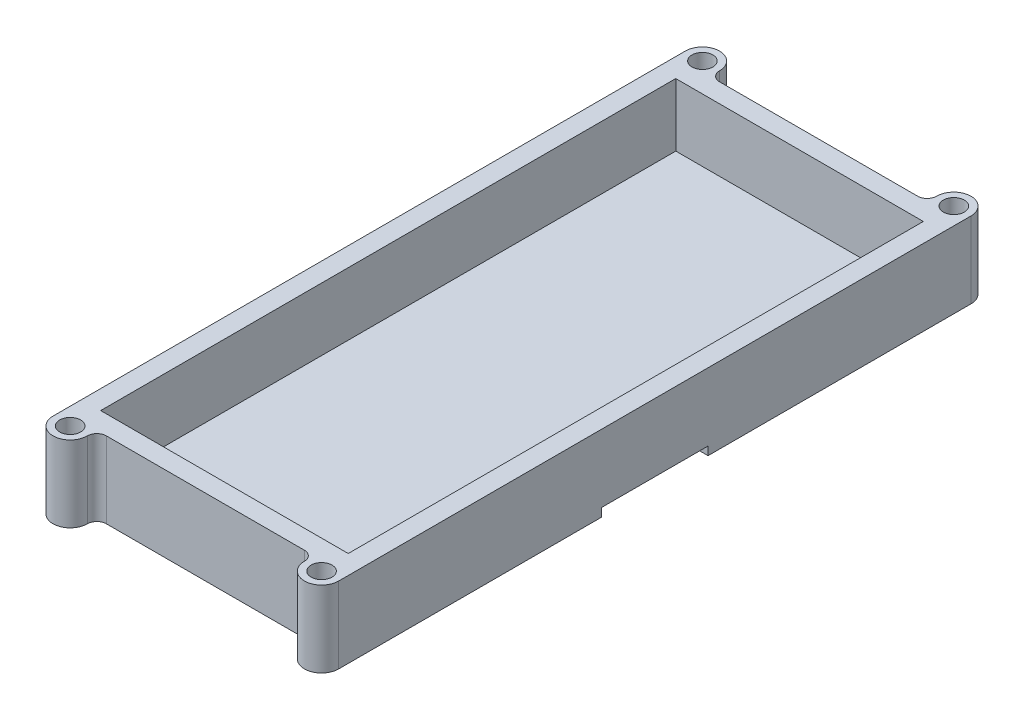
ISO-10303-21;
HEADER;
FILE_DESCRIPTION(('STEP AP214'),'2;1');
FILE_NAME('part.step','',(''),(''),'','','');
FILE_SCHEMA(('AUTOMOTIVE_DESIGN { 1 0 10303 214 1 1 1 1 }'));
ENDSEC;
DATA;
#1=APPLICATION_CONTEXT('core data for automotive mechanical design processes');
#2=APPLICATION_PROTOCOL_DEFINITION('international standard','automotive_design',2000,#1);
#3=PRODUCT_CONTEXT('',#1,'mechanical');
#4=PRODUCT('Part','Part','',(#3));
#5=PRODUCT_RELATED_PRODUCT_CATEGORY('part','',(#4));
#6=PRODUCT_DEFINITION_FORMATION('','',#4);
#7=PRODUCT_DEFINITION_CONTEXT('part definition',#1,'design');
#8=PRODUCT_DEFINITION('design','',#6,#7);
#9=PRODUCT_DEFINITION_SHAPE('','',#8);
#10=(LENGTH_UNIT() NAMED_UNIT(*) SI_UNIT(.MILLI.,.METRE.));
#11=(NAMED_UNIT(*) PLANE_ANGLE_UNIT() SI_UNIT($,.RADIAN.));
#12=(NAMED_UNIT(*) SI_UNIT($,.STERADIAN.) SOLID_ANGLE_UNIT());
#13=UNCERTAINTY_MEASURE_WITH_UNIT(LENGTH_MEASURE(1.E-05),#10,'distance_accuracy_value','');
#14=(GEOMETRIC_REPRESENTATION_CONTEXT(3) GLOBAL_UNCERTAINTY_ASSIGNED_CONTEXT((#13)) GLOBAL_UNIT_ASSIGNED_CONTEXT((#10,
#11,#12)) REPRESENTATION_CONTEXT('',''));
#15=CARTESIAN_POINT('',(0.,0.,0.));
#16=DIRECTION('',(0.,0.,1.));
#17=DIRECTION('',(1.,0.,0.));
#18=AXIS2_PLACEMENT_3D('',#15,#16,#17);
#19=CARTESIAN_POINT('',(33.,0.,83.));
#20=DIRECTION('',(0.,-1.,0.));
#21=DIRECTION('',(0.,0.,-1.));
#22=AXIS2_PLACEMENT_3D('',#19,#20,#21);
#23=PLANE('',#22);
#24=DIRECTION('',(-1.,0.,0.));
#25=VECTOR('',#24,1.);
#26=CARTESIAN_POINT('',(37.5,0.,-13.97));
#27=LINE('',#26,#25);
#28=CARTESIAN_POINT('',(37.5,0.,-13.97));
#29=VERTEX_POINT('',#28);
#30=CARTESIAN_POINT('',(-37.5000000000001,0.,-13.97));
#31=VERTEX_POINT('',#30);
#32=EDGE_CURVE('E177',#29,#31,#27,.T.);
#33=ORIENTED_EDGE('',*,*,#32,.T.);
#34=DIRECTION('',(0.,0.,1.));
#35=VECTOR('',#34,1.);
#36=CARTESIAN_POINT('',(-37.5,0.,75.5));
#37=LINE('',#36,#35);
#38=CARTESIAN_POINT('',(-37.5,0.,-83.));
#39=VERTEX_POINT('',#38);
#40=EDGE_CURVE('E230',#39,#31,#37,.T.);
#41=ORIENTED_EDGE('',*,*,#40,.F.);
#42=CARTESIAN_POINT('',(-33.,0.,-83.));
#43=DIRECTION('',(0.,1.,0.));
#44=DIRECTION('',(0.,0.,-1.));
#45=AXIS2_PLACEMENT_3D('',#42,#43,#44);
#46=CIRCLE('',#45,4.5);
#47=CARTESIAN_POINT('',(-28.5,0.,-83.));
#48=VERTEX_POINT('',#47);
#49=EDGE_CURVE('E225',#48,#39,#46,.T.);
#50=ORIENTED_EDGE('',*,*,#49,.F.);
#51=CARTESIAN_POINT('',(-26.,0.,-83.));
#52=DIRECTION('',(0.,-1.,0.));
#53=DIRECTION('',(0.,0.,-1.));
#54=AXIS2_PLACEMENT_3D('',#51,#52,#53);
#55=CIRCLE('',#54,2.5);
#56=CARTESIAN_POINT('',(-26.,0.,-80.5));
#57=VERTEX_POINT('',#56);
#58=EDGE_CURVE('E48',#48,#57,#55,.F.);
#59=ORIENTED_EDGE('',*,*,#58,.T.);
#60=DIRECTION('',(-1.,0.,0.));
#61=VECTOR('',#60,1.);
#62=CARTESIAN_POINT('',(-28.5,0.,-80.5));
#63=LINE('',#62,#61);
#64=CARTESIAN_POINT('',(26.,0.,-80.5));
#65=VERTEX_POINT('',#64);
#66=EDGE_CURVE('E222',#65,#57,#63,.T.);
#67=ORIENTED_EDGE('',*,*,#66,.F.);
#68=CARTESIAN_POINT('',(26.,0.,-83.));
#69=DIRECTION('',(0.,-1.,0.));
#70=DIRECTION('',(0.,0.,-1.));
#71=AXIS2_PLACEMENT_3D('',#68,#69,#70);
#72=CIRCLE('',#71,2.5);
#73=CARTESIAN_POINT('',(28.5,0.,-83.));
#74=VERTEX_POINT('',#73);
#75=EDGE_CURVE('E302',#65,#74,#72,.F.);
#76=ORIENTED_EDGE('',*,*,#75,.T.);
#77=CARTESIAN_POINT('',(33.,0.,-83.));
#78=DIRECTION('',(0.,1.,0.));
#79=DIRECTION('',(0.,0.,1.));
#80=AXIS2_PLACEMENT_3D('',#77,#78,#79);
#81=CIRCLE('',#80,4.5);
#82=CARTESIAN_POINT('',(37.5,0.,-83.));
#83=VERTEX_POINT('',#82);
#84=EDGE_CURVE('E205',#83,#74,#81,.T.);
#85=ORIENTED_EDGE('',*,*,#84,.F.);
#86=DIRECTION('',(0.,0.,-1.));
#87=VECTOR('',#86,1.);
#88=CARTESIAN_POINT('',(37.5,0.,-75.5));
#89=LINE('',#88,#87);
#90=EDGE_CURVE('E194',#29,#83,#89,.T.);
#91=ORIENTED_EDGE('',*,*,#90,.F.);
#92=EDGE_LOOP('',(#33,#41,#50,#59,#67,#76,#85,#91));
#93=FACE_BOUND('',#92,.T.);
#94=CARTESIAN_POINT('',(-33.,0.,-83.));
#95=DIRECTION('',(0.,1.,0.));
#96=DIRECTION('',(0.,0.,-1.));
#97=AXIS2_PLACEMENT_3D('',#94,#95,#96);
#98=CIRCLE('',#97,2.75);
#99=CARTESIAN_POINT('',(-33.,0.,-85.75));
#100=VERTEX_POINT('',#99);
#101=EDGE_CURVE('E402',#100,#100,#98,.T.);
#102=ORIENTED_EDGE('',*,*,#101,.T.);
#103=EDGE_LOOP('',(#102));
#104=FACE_BOUND('',#103,.T.);
#105=CARTESIAN_POINT('',(33.,0.,-83.));
#106=DIRECTION('',(0.,1.,0.));
#107=DIRECTION('',(0.,0.,1.));
#108=AXIS2_PLACEMENT_3D('',#105,#106,#107);
#109=CIRCLE('',#108,2.75);
#110=CARTESIAN_POINT('',(33.,0.,-80.25));
#111=VERTEX_POINT('',#110);
#112=EDGE_CURVE('E394',#111,#111,#109,.T.);
#113=ORIENTED_EDGE('',*,*,#112,.T.);
#114=EDGE_LOOP('',(#113));
#115=FACE_BOUND('',#114,.T.);
#116=ADVANCED_FACE('F39',(#93,#104,#115),#23,.T.);
#117=CARTESIAN_POINT('',(32.5,20.,75.5));
#118=DIRECTION('',(-1.,0.,0.));
#119=DIRECTION('',(0.,0.,1.));
#120=AXIS2_PLACEMENT_3D('',#117,#118,#119);
#121=PLANE('',#120);
#122=DIRECTION('',(0.,-1.,0.));
#123=VECTOR('',#122,1.);
#124=CARTESIAN_POINT('',(32.5,20.,-75.5));
#125=LINE('',#124,#123);
#126=CARTESIAN_POINT('',(32.5,20.,-75.5));
#127=VERTEX_POINT('',#126);
#128=CARTESIAN_POINT('',(32.5,3.5,-75.5));
#129=VERTEX_POINT('',#128);
#130=EDGE_CURVE('E208',#127,#129,#125,.T.);
#131=ORIENTED_EDGE('',*,*,#130,.T.);
#132=DIRECTION('',(0.,0.,1.));
#133=VECTOR('',#132,1.);
#134=CARTESIAN_POINT('',(32.5,3.5,75.5));
#135=LINE('',#134,#133);
#136=CARTESIAN_POINT('',(32.5,3.5,75.5));
#137=VERTEX_POINT('',#136);
#138=EDGE_CURVE('E413',#129,#137,#135,.T.);
#139=ORIENTED_EDGE('',*,*,#138,.T.);
#140=DIRECTION('',(0.,-1.,0.));
#141=VECTOR('',#140,1.);
#142=CARTESIAN_POINT('',(32.5,20.,75.5));
#143=LINE('',#142,#141);
#144=CARTESIAN_POINT('',(32.5,20.,75.5));
#145=VERTEX_POINT('',#144);
#146=EDGE_CURVE('E360',#145,#137,#143,.T.);
#147=ORIENTED_EDGE('',*,*,#146,.F.);
#148=DIRECTION('',(0.,0.,-1.));
#149=VECTOR('',#148,1.);
#150=CARTESIAN_POINT('',(32.5,20.,75.5));
#151=LINE('',#150,#149);
#152=EDGE_CURVE('E374',#145,#127,#151,.T.);
#153=ORIENTED_EDGE('',*,*,#152,.T.);
#154=EDGE_LOOP('',(#131,#139,#147,#153));
#155=FACE_BOUND('',#154,.T.);
#156=ADVANCED_FACE('F477',(#155),#121,.T.);
#157=CARTESIAN_POINT('',(32.5,20.,-75.5));
#158=DIRECTION('',(0.,0.,1.));
#159=DIRECTION('',(1.,0.,0.));
#160=AXIS2_PLACEMENT_3D('',#157,#158,#159);
#161=PLANE('',#160);
#162=DIRECTION('',(0.,-1.,0.));
#163=VECTOR('',#162,1.);
#164=CARTESIAN_POINT('',(-32.5,20.,-75.5));
#165=LINE('',#164,#163);
#166=CARTESIAN_POINT('',(-32.5,20.,-75.5));
#167=VERTEX_POINT('',#166);
#168=CARTESIAN_POINT('',(-32.5,3.5,-75.5));
#169=VERTEX_POINT('',#168);
#170=EDGE_CURVE('E214',#167,#169,#165,.T.);
#171=ORIENTED_EDGE('',*,*,#170,.T.);
#172=DIRECTION('',(1.,0.,0.));
#173=VECTOR('',#172,1.);
#174=CARTESIAN_POINT('',(-32.5,3.5,-75.5));
#175=LINE('',#174,#173);
#176=EDGE_CURVE('E417',#169,#129,#175,.T.);
#177=ORIENTED_EDGE('',*,*,#176,.T.);
#178=ORIENTED_EDGE('',*,*,#130,.F.);
#179=DIRECTION('',(-1.,0.,0.));
#180=VECTOR('',#179,1.);
#181=CARTESIAN_POINT('',(32.5,20.,-75.5));
#182=LINE('',#181,#180);
#183=EDGE_CURVE('E371',#127,#167,#182,.T.);
#184=ORIENTED_EDGE('',*,*,#183,.T.);
#185=EDGE_LOOP('',(#171,#177,#178,#184));
#186=FACE_BOUND('',#185,.T.);
#187=ADVANCED_FACE('F482',(#186),#161,.T.);
#188=CARTESIAN_POINT('',(-32.5,20.,75.5));
#189=DIRECTION('',(1.,0.,0.));
#190=DIRECTION('',(0.,0.,-1.));
#191=AXIS2_PLACEMENT_3D('',#188,#189,#190);
#192=PLANE('',#191);
#193=DIRECTION('',(0.,-1.,0.));
#194=VECTOR('',#193,1.);
#195=CARTESIAN_POINT('',(-32.5,20.,75.5));
#196=LINE('',#195,#194);
#197=CARTESIAN_POINT('',(-32.5,20.,75.5));
#198=VERTEX_POINT('',#197);
#199=CARTESIAN_POINT('',(-32.5,3.5,75.5));
#200=VERTEX_POINT('',#199);
#201=EDGE_CURVE('E356',#198,#200,#196,.T.);
#202=ORIENTED_EDGE('',*,*,#201,.T.);
#203=DIRECTION('',(0.,0.,-1.));
#204=VECTOR('',#203,1.);
#205=CARTESIAN_POINT('',(-32.5,3.5,75.5));
#206=LINE('',#205,#204);
#207=EDGE_CURVE('E421',#200,#169,#206,.T.);
#208=ORIENTED_EDGE('',*,*,#207,.T.);
#209=ORIENTED_EDGE('',*,*,#170,.F.);
#210=DIRECTION('',(0.,0.,1.));
#211=VECTOR('',#210,1.);
#212=CARTESIAN_POINT('',(-32.5,20.,75.5));
#213=LINE('',#212,#211);
#214=EDGE_CURVE('E367',#167,#198,#213,.T.);
#215=ORIENTED_EDGE('',*,*,#214,.T.);
#216=EDGE_LOOP('',(#202,#208,#209,#215));
#217=FACE_BOUND('',#216,.T.);
#218=ADVANCED_FACE('F498',(#217),#192,.T.);
#219=CARTESIAN_POINT('',(32.5,20.,75.5));
#220=DIRECTION('',(0.,0.,-1.));
#221=DIRECTION('',(-1.,0.,0.));
#222=AXIS2_PLACEMENT_3D('',#219,#220,#221);
#223=PLANE('',#222);
#224=ORIENTED_EDGE('',*,*,#146,.T.);
#225=DIRECTION('',(-1.,0.,0.));
#226=VECTOR('',#225,1.);
#227=CARTESIAN_POINT('',(-32.5,3.5,75.5));
#228=LINE('',#227,#226);
#229=EDGE_CURVE('E406',#137,#200,#228,.T.);
#230=ORIENTED_EDGE('',*,*,#229,.T.);
#231=ORIENTED_EDGE('',*,*,#201,.F.);
#232=DIRECTION('',(1.,0.,0.));
#233=VECTOR('',#232,1.);
#234=CARTESIAN_POINT('',(32.5,20.,75.5));
#235=LINE('',#234,#233);
#236=EDGE_CURVE('E364',#198,#145,#235,.T.);
#237=ORIENTED_EDGE('',*,*,#236,.T.);
#238=EDGE_LOOP('',(#224,#230,#231,#237));
#239=FACE_BOUND('',#238,.T.);
#240=ADVANCED_FACE('F494',(#239),#223,.T.);
#241=CARTESIAN_POINT('',(33.,20.,83.));
#242=DIRECTION('',(0.,-1.,0.));
#243=DIRECTION('',(0.,0.,-1.));
#244=AXIS2_PLACEMENT_3D('',#241,#242,#243);
#245=PLANE('',#244);
#246=DIRECTION('',(0.,0.,-1.));
#247=VECTOR('',#246,1.);
#248=CARTESIAN_POINT('',(37.5,20.,75.5));
#249=LINE('',#248,#247);
#250=CARTESIAN_POINT('',(37.5,20.,83.));
#251=VERTEX_POINT('',#250);
#252=CARTESIAN_POINT('',(37.5,20.,-83.));
#253=VERTEX_POINT('',#252);
#254=EDGE_CURVE('E245',#251,#253,#249,.T.);
#255=ORIENTED_EDGE('',*,*,#254,.T.);
#256=CARTESIAN_POINT('',(33.,20.,-83.));
#257=DIRECTION('',(0.,1.,0.));
#258=DIRECTION('',(0.,0.,1.));
#259=AXIS2_PLACEMENT_3D('',#256,#257,#258);
#260=CIRCLE('',#259,4.5);
#261=CARTESIAN_POINT('',(28.5,20.,-83.));
#262=VERTEX_POINT('',#261);
#263=EDGE_CURVE('E330',#253,#262,#260,.T.);
#264=ORIENTED_EDGE('',*,*,#263,.T.);
#265=CARTESIAN_POINT('',(26.,20.,-83.));
#266=DIRECTION('',(0.,-1.,0.));
#267=DIRECTION('',(0.,0.,-1.));
#268=AXIS2_PLACEMENT_3D('',#265,#266,#267);
#269=CIRCLE('',#268,2.5);
#270=CARTESIAN_POINT('',(26.,20.,-80.5));
#271=VERTEX_POINT('',#270);
#272=EDGE_CURVE('E62',#262,#271,#269,.T.);
#273=ORIENTED_EDGE('',*,*,#272,.T.);
#274=DIRECTION('',(-1.,0.,0.));
#275=VECTOR('',#274,1.);
#276=CARTESIAN_POINT('',(-28.5,20.,-80.5));
#277=LINE('',#276,#275);
#278=CARTESIAN_POINT('',(-26.,20.,-80.5));
#279=VERTEX_POINT('',#278);
#280=EDGE_CURVE('E319',#271,#279,#277,.T.);
#281=ORIENTED_EDGE('',*,*,#280,.T.);
#282=CARTESIAN_POINT('',(-26.,20.,-83.));
#283=DIRECTION('',(0.,-1.,0.));
#284=DIRECTION('',(0.,0.,-1.));
#285=AXIS2_PLACEMENT_3D('',#282,#283,#284);
#286=CIRCLE('',#285,2.5);
#287=CARTESIAN_POINT('',(-28.5,20.,-83.));
#288=VERTEX_POINT('',#287);
#289=EDGE_CURVE('E11',#279,#288,#286,.T.);
#290=ORIENTED_EDGE('',*,*,#289,.T.);
#291=CARTESIAN_POINT('',(-33.,20.,-83.));
#292=DIRECTION('',(0.,1.,0.));
#293=DIRECTION('',(0.,0.,-1.));
#294=AXIS2_PLACEMENT_3D('',#291,#292,#293);
#295=CIRCLE('',#294,4.5);
#296=CARTESIAN_POINT('',(-37.5,20.,-83.));
#297=VERTEX_POINT('',#296);
#298=EDGE_CURVE('E317',#288,#297,#295,.T.);
#299=ORIENTED_EDGE('',*,*,#298,.T.);
#300=DIRECTION('',(0.,0.,1.));
#301=VECTOR('',#300,1.);
#302=CARTESIAN_POINT('',(-37.5,20.,-75.5));
#303=LINE('',#302,#301);
#304=CARTESIAN_POINT('',(-37.5,20.,83.));
#305=VERTEX_POINT('',#304);
#306=EDGE_CURVE('E324',#297,#305,#303,.T.);
#307=ORIENTED_EDGE('',*,*,#306,.T.);
#308=CARTESIAN_POINT('',(-33.,20.,83.));
#309=DIRECTION('',(0.,1.,0.));
#310=DIRECTION('',(0.,0.,1.));
#311=AXIS2_PLACEMENT_3D('',#308,#309,#310);
#312=CIRCLE('',#311,4.5);
#313=CARTESIAN_POINT('',(-28.5,20.,83.));
#314=VERTEX_POINT('',#313);
#315=EDGE_CURVE('E328',#305,#314,#312,.T.);
#316=ORIENTED_EDGE('',*,*,#315,.T.);
#317=CARTESIAN_POINT('',(-26.,20.,83.));
#318=DIRECTION('',(0.,-1.,0.));
#319=DIRECTION('',(0.,0.,-1.));
#320=AXIS2_PLACEMENT_3D('',#317,#318,#319);
#321=CIRCLE('',#320,2.5);
#322=CARTESIAN_POINT('',(-26.,20.,80.5));
#323=VERTEX_POINT('',#322);
#324=EDGE_CURVE('E299',#314,#323,#321,.T.);
#325=ORIENTED_EDGE('',*,*,#324,.T.);
#326=DIRECTION('',(1.,0.,0.));
#327=VECTOR('',#326,1.);
#328=CARTESIAN_POINT('',(-28.5,20.,80.5));
#329=LINE('',#328,#327);
#330=CARTESIAN_POINT('',(26.,20.,80.5));
#331=VERTEX_POINT('',#330);
#332=EDGE_CURVE('E335',#323,#331,#329,.T.);
#333=ORIENTED_EDGE('',*,*,#332,.T.);
#334=CARTESIAN_POINT('',(26.,20.,83.));
#335=DIRECTION('',(0.,-1.,0.));
#336=DIRECTION('',(0.,0.,-1.));
#337=AXIS2_PLACEMENT_3D('',#334,#335,#336);
#338=CIRCLE('',#337,2.5);
#339=CARTESIAN_POINT('',(28.5,20.,83.));
#340=VERTEX_POINT('',#339);
#341=EDGE_CURVE('E293',#331,#340,#338,.T.);
#342=ORIENTED_EDGE('',*,*,#341,.T.);
#343=CARTESIAN_POINT('',(33.,20.,83.));
#344=DIRECTION('',(0.,1.,0.));
#345=DIRECTION('',(0.,0.,-1.));
#346=AXIS2_PLACEMENT_3D('',#343,#344,#345);
#347=CIRCLE('',#346,4.5);
#348=EDGE_CURVE('E218',#340,#251,#347,.T.);
#349=ORIENTED_EDGE('',*,*,#348,.T.);
#350=EDGE_LOOP('',(#255,#264,#273,#281,#290,#299,#307,#316,#325,#333,#342,#349));
#351=FACE_BOUND('',#350,.T.);
#352=ORIENTED_EDGE('',*,*,#152,.F.);
#353=ORIENTED_EDGE('',*,*,#236,.F.);
#354=ORIENTED_EDGE('',*,*,#214,.F.);
#355=ORIENTED_EDGE('',*,*,#183,.F.);
#356=EDGE_LOOP('',(#352,#353,#354,#355));
#357=FACE_BOUND('',#356,.T.);
#358=CARTESIAN_POINT('',(-33.,20.,83.));
#359=DIRECTION('',(0.,1.,0.));
#360=DIRECTION('',(0.,0.,1.));
#361=AXIS2_PLACEMENT_3D('',#358,#359,#360);
#362=CIRCLE('',#361,2.75);
#363=CARTESIAN_POINT('',(-33.,20.,85.75));
#364=VERTEX_POINT('',#363);
#365=EDGE_CURVE('E377',#364,#364,#362,.T.);
#366=ORIENTED_EDGE('',*,*,#365,.F.);
#367=EDGE_LOOP('',(#366));
#368=FACE_BOUND('',#367,.T.);
#369=CARTESIAN_POINT('',(33.,20.,83.));
#370=DIRECTION('',(0.,1.,0.));
#371=DIRECTION('',(0.,0.,-1.));
#372=AXIS2_PLACEMENT_3D('',#369,#370,#371);
#373=CIRCLE('',#372,2.75);
#374=CARTESIAN_POINT('',(33.,20.,80.25));
#375=VERTEX_POINT('',#374);
#376=EDGE_CURVE('E382',#375,#375,#373,.T.);
#377=ORIENTED_EDGE('',*,*,#376,.F.);
#378=EDGE_LOOP('',(#377));
#379=FACE_BOUND('',#378,.T.);
#380=CARTESIAN_POINT('',(33.,20.,-83.));
#381=DIRECTION('',(0.,1.,0.));
#382=DIRECTION('',(0.,0.,1.));
#383=AXIS2_PLACEMENT_3D('',#380,#381,#382);
#384=CIRCLE('',#383,2.75);
#385=CARTESIAN_POINT('',(33.,20.,-80.25));
#386=VERTEX_POINT('',#385);
#387=EDGE_CURVE('E390',#386,#386,#384,.T.);
#388=ORIENTED_EDGE('',*,*,#387,.F.);
#389=EDGE_LOOP('',(#388));
#390=FACE_BOUND('',#389,.T.);
#391=CARTESIAN_POINT('',(-33.,20.,-83.));
#392=DIRECTION('',(0.,1.,0.));
#393=DIRECTION('',(0.,0.,-1.));
#394=AXIS2_PLACEMENT_3D('',#391,#392,#393);
#395=CIRCLE('',#394,2.75);
#396=CARTESIAN_POINT('',(-33.,20.,-85.75));
#397=VERTEX_POINT('',#396);
#398=EDGE_CURVE('E398',#397,#397,#395,.T.);
#399=ORIENTED_EDGE('',*,*,#398,.F.);
#400=EDGE_LOOP('',(#399));
#401=FACE_BOUND('',#400,.T.);
#402=ADVANCED_FACE('F315',(#351,#357,#368,#379,#390,#401),#245,.F.);
#403=DIRECTION('',(-1.,0.,0.));
#404=VECTOR('',#403,1.);
#405=CARTESIAN_POINT('',(37.5,0.,13.97));
#406=LINE('',#405,#404);
#407=CARTESIAN_POINT('',(37.5,0.,13.97));
#408=VERTEX_POINT('',#407);
#409=CARTESIAN_POINT('',(-37.5,0.,13.97));
#410=VERTEX_POINT('',#409);
#411=EDGE_CURVE('E188',#408,#410,#406,.T.);
#412=ORIENTED_EDGE('',*,*,#411,.F.);
#413=CARTESIAN_POINT('',(37.5,0.,83.));
#414=VERTEX_POINT('',#413);
#415=EDGE_CURVE('E207',#414,#408,#89,.T.);
#416=ORIENTED_EDGE('',*,*,#415,.F.);
#417=CARTESIAN_POINT('',(33.,0.,83.));
#418=DIRECTION('',(0.,1.,0.));
#419=DIRECTION('',(0.,0.,-1.));
#420=AXIS2_PLACEMENT_3D('',#417,#418,#419);
#421=CIRCLE('',#420,4.5);
#422=CARTESIAN_POINT('',(28.5,0.,83.));
#423=VERTEX_POINT('',#422);
#424=EDGE_CURVE('E241',#423,#414,#421,.T.);
#425=ORIENTED_EDGE('',*,*,#424,.F.);
#426=CARTESIAN_POINT('',(26.,0.,83.));
#427=DIRECTION('',(0.,-1.,0.));
#428=DIRECTION('',(0.,0.,-1.));
#429=AXIS2_PLACEMENT_3D('',#426,#427,#428);
#430=CIRCLE('',#429,2.5);
#431=CARTESIAN_POINT('',(26.,0.,80.5));
#432=VERTEX_POINT('',#431);
#433=EDGE_CURVE('E290',#423,#432,#430,.F.);
#434=ORIENTED_EDGE('',*,*,#433,.T.);
#435=DIRECTION('',(1.,0.,0.));
#436=VECTOR('',#435,1.);
#437=CARTESIAN_POINT('',(-28.5,0.,80.5));
#438=LINE('',#437,#436);
#439=CARTESIAN_POINT('',(-26.,0.,80.5));
#440=VERTEX_POINT('',#439);
#441=EDGE_CURVE('E237',#440,#432,#438,.T.);
#442=ORIENTED_EDGE('',*,*,#441,.F.);
#443=CARTESIAN_POINT('',(-26.,0.,83.));
#444=DIRECTION('',(0.,-1.,0.));
#445=DIRECTION('',(0.,0.,-1.));
#446=AXIS2_PLACEMENT_3D('',#443,#444,#445);
#447=CIRCLE('',#446,2.5);
#448=CARTESIAN_POINT('',(-28.5,0.,83.));
#449=VERTEX_POINT('',#448);
#450=EDGE_CURVE('E296',#440,#449,#447,.F.);
#451=ORIENTED_EDGE('',*,*,#450,.T.);
#452=CARTESIAN_POINT('',(-33.,0.,83.));
#453=DIRECTION('',(0.,1.,0.));
#454=DIRECTION('',(0.,0.,1.));
#455=AXIS2_PLACEMENT_3D('',#452,#453,#454);
#456=CIRCLE('',#455,4.5);
#457=CARTESIAN_POINT('',(-37.5,0.,83.));
#458=VERTEX_POINT('',#457);
#459=EDGE_CURVE('E233',#458,#449,#456,.T.);
#460=ORIENTED_EDGE('',*,*,#459,.F.);
#461=EDGE_CURVE('E229',#410,#458,#37,.T.);
#462=ORIENTED_EDGE('',*,*,#461,.F.);
#463=EDGE_LOOP('',(#412,#416,#425,#434,#442,#451,#460,#462));
#464=FACE_BOUND('',#463,.T.);
#465=CARTESIAN_POINT('',(-33.,0.,83.));
#466=DIRECTION('',(0.,1.,0.));
#467=DIRECTION('',(0.,0.,1.));
#468=AXIS2_PLACEMENT_3D('',#465,#466,#467);
#469=CIRCLE('',#468,2.75);
#470=CARTESIAN_POINT('',(-33.,0.,85.75));
#471=VERTEX_POINT('',#470);
#472=EDGE_CURVE('E378',#471,#471,#469,.T.);
#473=ORIENTED_EDGE('',*,*,#472,.T.);
#474=EDGE_LOOP('',(#473));
#475=FACE_BOUND('',#474,.T.);
#476=CARTESIAN_POINT('',(33.,0.,83.));
#477=DIRECTION('',(0.,1.,0.));
#478=DIRECTION('',(0.,0.,-1.));
#479=AXIS2_PLACEMENT_3D('',#476,#477,#478);
#480=CIRCLE('',#479,2.75);
#481=CARTESIAN_POINT('',(33.,0.,80.25));
#482=VERTEX_POINT('',#481);
#483=EDGE_CURVE('E386',#482,#482,#480,.T.);
#484=ORIENTED_EDGE('',*,*,#483,.T.);
#485=EDGE_LOOP('',(#484));
#486=FACE_BOUND('',#485,.T.);
#487=ADVANCED_FACE('F451',(#464,#475,#486),#23,.T.);
#488=CARTESIAN_POINT('',(37.5,20.,-75.5));
#489=DIRECTION('',(-1.,0.,0.));
#490=DIRECTION('',(0.,0.,1.));
#491=AXIS2_PLACEMENT_3D('',#488,#489,#490);
#492=PLANE('',#491);
#493=DIRECTION('',(0.,0.,-1.));
#494=VECTOR('',#493,1.);
#495=CARTESIAN_POINT('',(37.5,2.2,-13.97));
#496=LINE('',#495,#494);
#497=CARTESIAN_POINT('',(37.5,2.2,13.97));
#498=VERTEX_POINT('',#497);
#499=CARTESIAN_POINT('',(37.5,2.2,-13.97));
#500=VERTEX_POINT('',#499);
#501=EDGE_CURVE('E189',#498,#500,#496,.T.);
#502=ORIENTED_EDGE('',*,*,#501,.T.);
#503=DIRECTION('',(0.,-1.,0.));
#504=VECTOR('',#503,1.);
#505=CARTESIAN_POINT('',(37.5,2.2,-13.97));
#506=LINE('',#505,#504);
#507=EDGE_CURVE('E180',#500,#29,#506,.T.);
#508=ORIENTED_EDGE('',*,*,#507,.T.);
#509=ORIENTED_EDGE('',*,*,#90,.T.);
#510=DIRECTION('',(0.,-1.,0.));
#511=VECTOR('',#510,1.);
#512=CARTESIAN_POINT('',(37.5,20.,-83.));
#513=LINE('',#512,#511);
#514=EDGE_CURVE('E274',#253,#83,#513,.T.);
#515=ORIENTED_EDGE('',*,*,#514,.F.);
#516=ORIENTED_EDGE('',*,*,#254,.F.);
#517=DIRECTION('',(0.,-1.,0.));
#518=VECTOR('',#517,1.);
#519=CARTESIAN_POINT('',(37.5,20.,83.));
#520=LINE('',#519,#518);
#521=EDGE_CURVE('E246',#251,#414,#520,.T.);
#522=ORIENTED_EDGE('',*,*,#521,.T.);
#523=ORIENTED_EDGE('',*,*,#415,.T.);
#524=DIRECTION('',(0.,1.,0.));
#525=VECTOR('',#524,1.);
#526=CARTESIAN_POINT('',(37.5,2.2,13.97));
#527=LINE('',#526,#525);
#528=EDGE_CURVE('E199',#408,#498,#527,.T.);
#529=ORIENTED_EDGE('',*,*,#528,.T.);
#530=EDGE_LOOP('',(#502,#508,#509,#515,#516,#522,#523,#529));
#531=FACE_BOUND('',#530,.T.);
#532=ADVANCED_FACE('F192',(#531),#492,.F.);
#533=CARTESIAN_POINT('',(33.,20.,-83.));
#534=DIRECTION('',(0.,-1.,0.));
#535=DIRECTION('',(0.,0.,-1.));
#536=AXIS2_PLACEMENT_3D('',#533,#534,#535);
#537=CYLINDRICAL_SURFACE('',#536,4.5);
#538=ORIENTED_EDGE('',*,*,#84,.T.);
#539=DIRECTION('',(0.,-1.,0.));
#540=VECTOR('',#539,1.);
#541=CARTESIAN_POINT('',(28.5,20.,-83.));
#542=LINE('',#541,#540);
#543=EDGE_CURVE('E270',#262,#74,#542,.T.);
#544=ORIENTED_EDGE('',*,*,#543,.F.);
#545=ORIENTED_EDGE('',*,*,#263,.F.);
#546=ORIENTED_EDGE('',*,*,#514,.T.);
#547=EDGE_LOOP('',(#538,#544,#545,#546));
#548=FACE_BOUND('',#547,.T.);
#549=ADVANCED_FACE('F492',(#548),#537,.T.);
#550=CARTESIAN_POINT('',(-28.5,20.,-80.5));
#551=DIRECTION('',(0.,0.,1.));
#552=DIRECTION('',(1.,0.,0.));
#553=AXIS2_PLACEMENT_3D('',#550,#551,#552);
#554=PLANE('',#553);
#555=ORIENTED_EDGE('',*,*,#280,.F.);
#556=DIRECTION('',(0.,-1.,0.));
#557=VECTOR('',#556,1.);
#558=CARTESIAN_POINT('',(26.,0.,-80.5));
#559=LINE('',#558,#557);
#560=EDGE_CURVE('E286',#271,#65,#559,.T.);
#561=ORIENTED_EDGE('',*,*,#560,.T.);
#562=ORIENTED_EDGE('',*,*,#66,.T.);
#563=DIRECTION('',(0.,-1.,0.));
#564=VECTOR('',#563,1.);
#565=CARTESIAN_POINT('',(-26.,20.,-80.5));
#566=LINE('',#565,#564);
#567=EDGE_CURVE('E55',#57,#279,#566,.F.);
#568=ORIENTED_EDGE('',*,*,#567,.T.);
#569=EDGE_LOOP('',(#555,#561,#562,#568));
#570=FACE_BOUND('',#569,.T.);
#571=ADVANCED_FACE('F311',(#570),#554,.F.);
#572=CARTESIAN_POINT('',(-33.,20.,-83.));
#573=DIRECTION('',(0.,-1.,0.));
#574=DIRECTION('',(0.,0.,-1.));
#575=AXIS2_PLACEMENT_3D('',#572,#573,#574);
#576=CYLINDRICAL_SURFACE('',#575,4.5);
#577=ORIENTED_EDGE('',*,*,#49,.T.);
#578=DIRECTION('',(0.,-1.,0.));
#579=VECTOR('',#578,1.);
#580=CARTESIAN_POINT('',(-37.5,20.,-83.));
#581=LINE('',#580,#579);
#582=EDGE_CURVE('E262',#297,#39,#581,.T.);
#583=ORIENTED_EDGE('',*,*,#582,.F.);
#584=ORIENTED_EDGE('',*,*,#298,.F.);
#585=DIRECTION('',(0.,-1.,0.));
#586=VECTOR('',#585,1.);
#587=CARTESIAN_POINT('',(-28.5,20.,-83.));
#588=LINE('',#587,#586);
#589=EDGE_CURVE('E266',#288,#48,#588,.T.);
#590=ORIENTED_EDGE('',*,*,#589,.T.);
#591=EDGE_LOOP('',(#577,#583,#584,#590));
#592=FACE_BOUND('',#591,.T.);
#593=ADVANCED_FACE('F321',(#592),#576,.T.);
#594=CARTESIAN_POINT('',(-37.5,20.,75.5));
#595=DIRECTION('',(1.,0.,0.));
#596=DIRECTION('',(0.,0.,-1.));
#597=AXIS2_PLACEMENT_3D('',#594,#595,#596);
#598=PLANE('',#597);
#599=ORIENTED_EDGE('',*,*,#40,.T.);
#600=DIRECTION('',(0.,-1.,0.));
#601=VECTOR('',#600,1.);
#602=CARTESIAN_POINT('',(-37.5000000000001,2.2,-13.97));
#603=LINE('',#602,#601);
#604=CARTESIAN_POINT('',(-37.5000000000001,2.2,-13.97));
#605=VERTEX_POINT('',#604);
#606=EDGE_CURVE('E183',#605,#31,#603,.T.);
#607=ORIENTED_EDGE('',*,*,#606,.F.);
#608=DIRECTION('',(0.,0.,-1.));
#609=VECTOR('',#608,1.);
#610=CARTESIAN_POINT('',(-37.5000000000001,2.2,-13.97));
#611=LINE('',#610,#609);
#612=CARTESIAN_POINT('',(-37.5000000000001,2.2,13.97));
#613=VERTEX_POINT('',#612);
#614=EDGE_CURVE('E200',#613,#605,#611,.T.);
#615=ORIENTED_EDGE('',*,*,#614,.F.);
#616=DIRECTION('',(0.,1.,0.));
#617=VECTOR('',#616,1.);
#618=CARTESIAN_POINT('',(-37.5000000000001,2.2,13.97));
#619=LINE('',#618,#617);
#620=EDGE_CURVE('E436',#410,#613,#619,.T.);
#621=ORIENTED_EDGE('',*,*,#620,.F.);
#622=ORIENTED_EDGE('',*,*,#461,.T.);
#623=DIRECTION('',(0.,-1.,0.));
#624=VECTOR('',#623,1.);
#625=CARTESIAN_POINT('',(-37.5,20.,83.));
#626=LINE('',#625,#624);
#627=EDGE_CURVE('E258',#305,#458,#626,.T.);
#628=ORIENTED_EDGE('',*,*,#627,.F.);
#629=ORIENTED_EDGE('',*,*,#306,.F.);
#630=ORIENTED_EDGE('',*,*,#582,.T.);
#631=EDGE_LOOP('',(#599,#607,#615,#621,#622,#628,#629,#630));
#632=FACE_BOUND('',#631,.T.);
#633=ADVANCED_FACE('F457',(#632),#598,.F.);
#634=CARTESIAN_POINT('',(-33.,20.,83.));
#635=DIRECTION('',(0.,-1.,0.));
#636=DIRECTION('',(0.,0.,-1.));
#637=AXIS2_PLACEMENT_3D('',#634,#635,#636);
#638=CYLINDRICAL_SURFACE('',#637,4.5);
#639=ORIENTED_EDGE('',*,*,#459,.T.);
#640=DIRECTION('',(0.,-1.,0.));
#641=VECTOR('',#640,1.);
#642=CARTESIAN_POINT('',(-28.5,20.,83.));
#643=LINE('',#642,#641);
#644=EDGE_CURVE('E254',#314,#449,#643,.T.);
#645=ORIENTED_EDGE('',*,*,#644,.F.);
#646=ORIENTED_EDGE('',*,*,#315,.F.);
#647=ORIENTED_EDGE('',*,*,#627,.T.);
#648=EDGE_LOOP('',(#639,#645,#646,#647));
#649=FACE_BOUND('',#648,.T.);
#650=ADVANCED_FACE('F461',(#649),#638,.T.);
#651=CARTESIAN_POINT('',(-28.5,20.,80.5));
#652=DIRECTION('',(0.,0.,-1.));
#653=DIRECTION('',(-1.,0.,0.));
#654=AXIS2_PLACEMENT_3D('',#651,#652,#653);
#655=PLANE('',#654);
#656=ORIENTED_EDGE('',*,*,#441,.T.);
#657=DIRECTION('',(0.,-1.,0.));
#658=VECTOR('',#657,1.);
#659=CARTESIAN_POINT('',(26.,20.,80.5));
#660=LINE('',#659,#658);
#661=EDGE_CURVE('E281',#432,#331,#660,.F.);
#662=ORIENTED_EDGE('',*,*,#661,.T.);
#663=ORIENTED_EDGE('',*,*,#332,.F.);
#664=DIRECTION('',(0.,-1.,0.));
#665=VECTOR('',#664,1.);
#666=CARTESIAN_POINT('',(-26.,0.,80.5));
#667=LINE('',#666,#665);
#668=EDGE_CURVE('E277',#323,#440,#667,.T.);
#669=ORIENTED_EDGE('',*,*,#668,.T.);
#670=EDGE_LOOP('',(#656,#662,#663,#669));
#671=FACE_BOUND('',#670,.T.);
#672=ADVANCED_FACE('F628',(#671),#655,.F.);
#673=CARTESIAN_POINT('',(33.,20.,83.));
#674=DIRECTION('',(0.,-1.,0.));
#675=DIRECTION('',(0.,0.,-1.));
#676=AXIS2_PLACEMENT_3D('',#673,#674,#675);
#677=CYLINDRICAL_SURFACE('',#676,4.5);
#678=ORIENTED_EDGE('',*,*,#424,.T.);
#679=ORIENTED_EDGE('',*,*,#521,.F.);
#680=ORIENTED_EDGE('',*,*,#348,.F.);
#681=DIRECTION('',(0.,-1.,0.));
#682=VECTOR('',#681,1.);
#683=CARTESIAN_POINT('',(28.5,20.,83.));
#684=LINE('',#683,#682);
#685=EDGE_CURVE('E250',#340,#423,#684,.T.);
#686=ORIENTED_EDGE('',*,*,#685,.T.);
#687=EDGE_LOOP('',(#678,#679,#680,#686));
#688=FACE_BOUND('',#687,.T.);
#689=ADVANCED_FACE('F346',(#688),#677,.T.);
#690=CARTESIAN_POINT('',(-33.,20.,83.));
#691=DIRECTION('',(0.,-1.,0.));
#692=DIRECTION('',(0.,0.,-1.));
#693=AXIS2_PLACEMENT_3D('',#690,#691,#692);
#694=CYLINDRICAL_SURFACE('',#693,2.75);
#695=ORIENTED_EDGE('',*,*,#365,.T.);
#696=EDGE_LOOP('',(#695));
#697=FACE_BOUND('',#696,.T.);
#698=ORIENTED_EDGE('',*,*,#472,.F.);
#699=EDGE_LOOP('',(#698));
#700=FACE_BOUND('',#699,.T.);
#701=ADVANCED_FACE('F508',(#697,#700),#694,.F.);
#702=CARTESIAN_POINT('',(33.,20.,83.));
#703=DIRECTION('',(0.,-1.,0.));
#704=DIRECTION('',(0.,0.,-1.));
#705=AXIS2_PLACEMENT_3D('',#702,#703,#704);
#706=CYLINDRICAL_SURFACE('',#705,2.75);
#707=ORIENTED_EDGE('',*,*,#376,.T.);
#708=EDGE_LOOP('',(#707));
#709=FACE_BOUND('',#708,.T.);
#710=ORIENTED_EDGE('',*,*,#483,.F.);
#711=EDGE_LOOP('',(#710));
#712=FACE_BOUND('',#711,.T.);
#713=ADVANCED_FACE('F511',(#709,#712),#706,.F.);
#714=CARTESIAN_POINT('',(33.,20.,-83.));
#715=DIRECTION('',(0.,-1.,0.));
#716=DIRECTION('',(0.,0.,-1.));
#717=AXIS2_PLACEMENT_3D('',#714,#715,#716);
#718=CYLINDRICAL_SURFACE('',#717,2.75);
#719=ORIENTED_EDGE('',*,*,#387,.T.);
#720=EDGE_LOOP('',(#719));
#721=FACE_BOUND('',#720,.T.);
#722=ORIENTED_EDGE('',*,*,#112,.F.);
#723=EDGE_LOOP('',(#722));
#724=FACE_BOUND('',#723,.T.);
#725=ADVANCED_FACE('F515',(#721,#724),#718,.F.);
#726=CARTESIAN_POINT('',(-33.,20.,-83.));
#727=DIRECTION('',(0.,-1.,0.));
#728=DIRECTION('',(0.,0.,-1.));
#729=AXIS2_PLACEMENT_3D('',#726,#727,#728);
#730=CYLINDRICAL_SURFACE('',#729,2.75);
#731=ORIENTED_EDGE('',*,*,#398,.T.);
#732=EDGE_LOOP('',(#731));
#733=FACE_BOUND('',#732,.T.);
#734=ORIENTED_EDGE('',*,*,#101,.F.);
#735=EDGE_LOOP('',(#734));
#736=FACE_BOUND('',#735,.T.);
#737=ADVANCED_FACE('F519',(#733,#736),#730,.F.);
#738=CARTESIAN_POINT('',(0.,3.5,0.));
#739=DIRECTION('',(0.,-1.,0.));
#740=DIRECTION('',(0.,0.,-1.));
#741=AXIS2_PLACEMENT_3D('',#738,#739,#740);
#742=PLANE('',#741);
#743=ORIENTED_EDGE('',*,*,#207,.F.);
#744=ORIENTED_EDGE('',*,*,#229,.F.);
#745=ORIENTED_EDGE('',*,*,#138,.F.);
#746=ORIENTED_EDGE('',*,*,#176,.F.);
#747=EDGE_LOOP('',(#743,#744,#745,#746));
#748=FACE_BOUND('',#747,.T.);
#749=ADVANCED_FACE('F474',(#748),#742,.F.);
#750=CARTESIAN_POINT('',(37.5,2.2,-13.97));
#751=DIRECTION('',(0.,0.,-1.));
#752=DIRECTION('',(-1.,0.,0.));
#753=AXIS2_PLACEMENT_3D('',#750,#751,#752);
#754=PLANE('',#753);
#755=ORIENTED_EDGE('',*,*,#606,.T.);
#756=ORIENTED_EDGE('',*,*,#32,.F.);
#757=ORIENTED_EDGE('',*,*,#507,.F.);
#758=DIRECTION('',(-1.,0.,0.));
#759=VECTOR('',#758,1.);
#760=CARTESIAN_POINT('',(37.5,2.2,-13.97));
#761=LINE('',#760,#759);
#762=EDGE_CURVE('E424',#500,#605,#761,.T.);
#763=ORIENTED_EDGE('',*,*,#762,.T.);
#764=EDGE_LOOP('',(#755,#756,#757,#763));
#765=FACE_BOUND('',#764,.T.);
#766=ADVANCED_FACE('F179',(#765),#754,.F.);
#767=CARTESIAN_POINT('',(37.5,2.2,-13.97));
#768=DIRECTION('',(0.,1.,0.));
#769=DIRECTION('',(0.,0.,1.));
#770=AXIS2_PLACEMENT_3D('',#767,#768,#769);
#771=PLANE('',#770);
#772=ORIENTED_EDGE('',*,*,#614,.T.);
#773=ORIENTED_EDGE('',*,*,#762,.F.);
#774=ORIENTED_EDGE('',*,*,#501,.F.);
#775=DIRECTION('',(-1.,0.,0.));
#776=VECTOR('',#775,1.);
#777=CARTESIAN_POINT('',(37.5,2.2,13.97));
#778=LINE('',#777,#776);
#779=EDGE_CURVE('E428',#498,#613,#778,.T.);
#780=ORIENTED_EDGE('',*,*,#779,.T.);
#781=EDGE_LOOP('',(#772,#773,#774,#780));
#782=FACE_BOUND('',#781,.T.);
#783=ADVANCED_FACE('F465',(#782),#771,.F.);
#784=CARTESIAN_POINT('',(37.5,2.2,13.97));
#785=DIRECTION('',(0.,0.,1.));
#786=DIRECTION('',(1.,0.,0.));
#787=AXIS2_PLACEMENT_3D('',#784,#785,#786);
#788=PLANE('',#787);
#789=ORIENTED_EDGE('',*,*,#620,.T.);
#790=ORIENTED_EDGE('',*,*,#779,.F.);
#791=ORIENTED_EDGE('',*,*,#528,.F.);
#792=ORIENTED_EDGE('',*,*,#411,.T.);
#793=EDGE_LOOP('',(#789,#790,#791,#792));
#794=FACE_BOUND('',#793,.T.);
#795=ADVANCED_FACE('F447',(#794),#788,.F.);
#796=CARTESIAN_POINT('',(26.,20.,83.));
#797=DIRECTION('',(0.,1.,0.));
#798=DIRECTION('',(0.,0.,1.));
#799=AXIS2_PLACEMENT_3D('',#796,#797,#798);
#800=CYLINDRICAL_SURFACE('',#799,2.5);
#801=ORIENTED_EDGE('',*,*,#341,.F.);
#802=ORIENTED_EDGE('',*,*,#661,.F.);
#803=ORIENTED_EDGE('',*,*,#433,.F.);
#804=ORIENTED_EDGE('',*,*,#685,.F.);
#805=EDGE_LOOP('',(#801,#802,#803,#804));
#806=FACE_BOUND('',#805,.T.);
#807=ADVANCED_FACE('F472',(#806),#800,.F.);
#808=CARTESIAN_POINT('',(-26.,20.,83.));
#809=DIRECTION('',(0.,1.,0.));
#810=DIRECTION('',(0.,0.,1.));
#811=AXIS2_PLACEMENT_3D('',#808,#809,#810);
#812=CYLINDRICAL_SURFACE('',#811,2.5);
#813=ORIENTED_EDGE('',*,*,#324,.F.);
#814=ORIENTED_EDGE('',*,*,#644,.T.);
#815=ORIENTED_EDGE('',*,*,#450,.F.);
#816=ORIENTED_EDGE('',*,*,#668,.F.);
#817=EDGE_LOOP('',(#813,#814,#815,#816));
#818=FACE_BOUND('',#817,.T.);
#819=ADVANCED_FACE('F652',(#818),#812,.F.);
#820=CARTESIAN_POINT('',(26.,20.,-83.));
#821=DIRECTION('',(0.,1.,0.));
#822=DIRECTION('',(0.,0.,1.));
#823=AXIS2_PLACEMENT_3D('',#820,#821,#822);
#824=CYLINDRICAL_SURFACE('',#823,2.5);
#825=ORIENTED_EDGE('',*,*,#272,.F.);
#826=ORIENTED_EDGE('',*,*,#543,.T.);
#827=ORIENTED_EDGE('',*,*,#75,.F.);
#828=ORIENTED_EDGE('',*,*,#560,.F.);
#829=EDGE_LOOP('',(#825,#826,#827,#828));
#830=FACE_BOUND('',#829,.T.);
#831=ADVANCED_FACE('F662',(#830),#824,.F.);
#832=CARTESIAN_POINT('',(-26.,20.,-83.));
#833=DIRECTION('',(0.,1.,0.));
#834=DIRECTION('',(0.,0.,1.));
#835=AXIS2_PLACEMENT_3D('',#832,#833,#834);
#836=CYLINDRICAL_SURFACE('',#835,2.5);
#837=ORIENTED_EDGE('',*,*,#289,.F.);
#838=ORIENTED_EDGE('',*,*,#567,.F.);
#839=ORIENTED_EDGE('',*,*,#58,.F.);
#840=ORIENTED_EDGE('',*,*,#589,.F.);
#841=EDGE_LOOP('',(#837,#838,#839,#840));
#842=FACE_BOUND('',#841,.T.);
#843=ADVANCED_FACE('F41',(#842),#836,.F.);
#844=CLOSED_SHELL('',(#116,#156,#187,#218,#240,#402,#487,#532,#549,#571,#593,#633,#650,#672,
#689,#701,#713,#725,#737,#749,#766,#783,#795,#807,#819,#831,#843));
#845=MANIFOLD_SOLID_BREP('B2',#844);
#846=ADVANCED_BREP_SHAPE_REPRESENTATION('',(#18,#845),#14);
#847=SHAPE_DEFINITION_REPRESENTATION(#9,#846);
ENDSEC;
END-ISO-10303-21;
